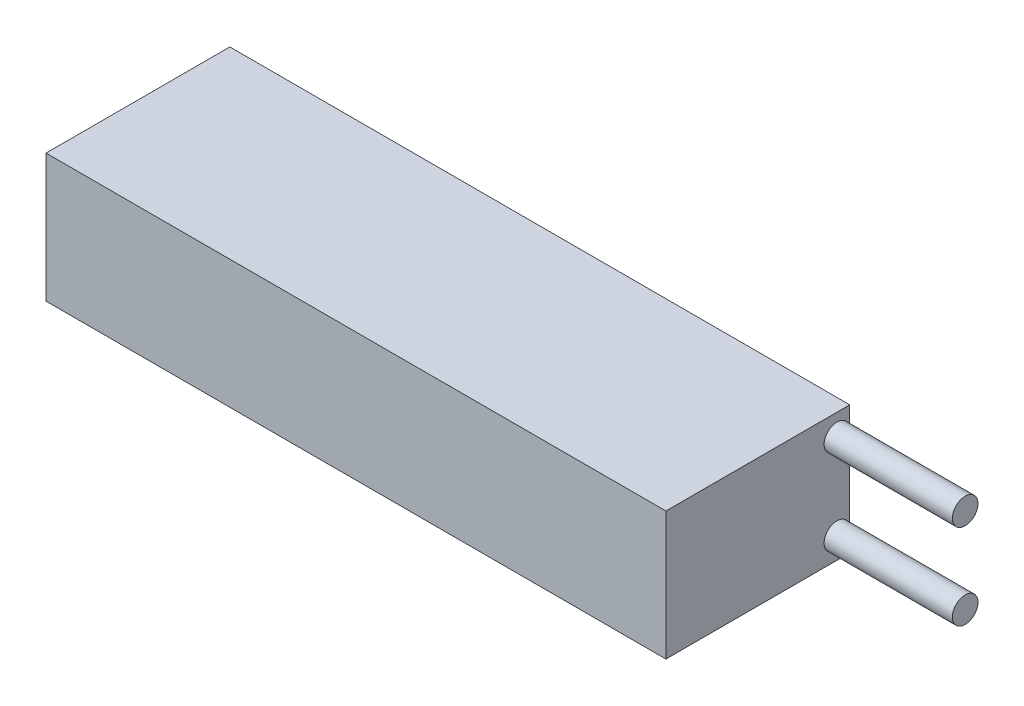
ISO-10303-21;
HEADER;
FILE_DESCRIPTION(('STEP AP214'),'2;1');
FILE_NAME('part.step','',(''),(''),'','','');
FILE_SCHEMA(('AUTOMOTIVE_DESIGN { 1 0 10303 214 1 1 1 1 }'));
ENDSEC;
DATA;
#1=APPLICATION_CONTEXT('core data for automotive mechanical design processes');
#2=APPLICATION_PROTOCOL_DEFINITION('international standard','automotive_design',2000,#1);
#3=PRODUCT_CONTEXT('',#1,'mechanical');
#4=PRODUCT('Part','Part','',(#3));
#5=PRODUCT_RELATED_PRODUCT_CATEGORY('part','',(#4));
#6=PRODUCT_DEFINITION_FORMATION('','',#4);
#7=PRODUCT_DEFINITION_CONTEXT('part definition',#1,'design');
#8=PRODUCT_DEFINITION('design','',#6,#7);
#9=PRODUCT_DEFINITION_SHAPE('','',#8);
#10=(LENGTH_UNIT() NAMED_UNIT(*) SI_UNIT(.MILLI.,.METRE.));
#11=(NAMED_UNIT(*) PLANE_ANGLE_UNIT() SI_UNIT($,.RADIAN.));
#12=(NAMED_UNIT(*) SI_UNIT($,.STERADIAN.) SOLID_ANGLE_UNIT());
#13=UNCERTAINTY_MEASURE_WITH_UNIT(LENGTH_MEASURE(1.E-05),#10,'distance_accuracy_value','');
#14=(GEOMETRIC_REPRESENTATION_CONTEXT(3) GLOBAL_UNCERTAINTY_ASSIGNED_CONTEXT((#13)) GLOBAL_UNIT_ASSIGNED_CONTEXT((#10,
#11,#12)) REPRESENTATION_CONTEXT('',''));
#15=CARTESIAN_POINT('',(0.,0.,0.));
#16=DIRECTION('',(0.,0.,1.));
#17=DIRECTION('',(1.,0.,0.));
#18=AXIS2_PLACEMENT_3D('',#15,#16,#17);
#19=CARTESIAN_POINT('',(72.5,30.,21.5));
#20=DIRECTION('',(-1.,0.,0.));
#21=DIRECTION('',(0.,0.,1.));
#22=AXIS2_PLACEMENT_3D('',#19,#20,#21);
#23=PLANE('',#22);
#24=DIRECTION('',(0.,-1.,0.));
#25=VECTOR('',#24,1.);
#26=CARTESIAN_POINT('',(72.5,30.,-21.5));
#27=LINE('',#26,#25);
#28=CARTESIAN_POINT('',(72.5,5.,-21.5));
#29=VERTEX_POINT('',#28);
#30=CARTESIAN_POINT('',(72.5,0.,-21.5));
#31=VERTEX_POINT('',#30);
#32=EDGE_CURVE('E41',#29,#31,#27,.T.);
#33=ORIENTED_EDGE('',*,*,#32,.F.);
#34=CARTESIAN_POINT('',(72.5,5.,-18.5));
#35=DIRECTION('',(1.,0.,0.));
#36=DIRECTION('',(0.,0.,1.));
#37=AXIS2_PLACEMENT_3D('',#34,#35,#36);
#38=CIRCLE('',#37,3.);
#39=EDGE_CURVE('E95',#29,#29,#38,.T.);
#40=ORIENTED_EDGE('',*,*,#39,.F.);
#41=CARTESIAN_POINT('',(72.5,25.,-21.5));
#42=VERTEX_POINT('',#41);
#43=EDGE_CURVE('E40',#42,#29,#27,.T.);
#44=ORIENTED_EDGE('',*,*,#43,.F.);
#45=CARTESIAN_POINT('',(72.5,25.,-18.5));
#46=DIRECTION('',(1.,0.,0.));
#47=DIRECTION('',(0.,0.,-1.));
#48=AXIS2_PLACEMENT_3D('',#45,#46,#47);
#49=CIRCLE('',#48,3.);
#50=EDGE_CURVE('E117',#42,#42,#49,.T.);
#51=ORIENTED_EDGE('',*,*,#50,.F.);
#52=CARTESIAN_POINT('',(72.5,30.,-21.5));
#53=VERTEX_POINT('',#52);
#54=EDGE_CURVE('E11',#53,#42,#27,.T.);
#55=ORIENTED_EDGE('',*,*,#54,.F.);
#56=DIRECTION('',(0.,0.,-1.));
#57=VECTOR('',#56,1.);
#58=CARTESIAN_POINT('',(72.5,30.,21.5));
#59=LINE('',#58,#57);
#60=CARTESIAN_POINT('',(72.5,30.,21.5));
#61=VERTEX_POINT('',#60);
#62=EDGE_CURVE('E106',#61,#53,#59,.T.);
#63=ORIENTED_EDGE('',*,*,#62,.F.);
#64=DIRECTION('',(0.,-1.,0.));
#65=VECTOR('',#64,1.);
#66=CARTESIAN_POINT('',(72.5,30.,21.5));
#67=LINE('',#66,#65);
#68=CARTESIAN_POINT('',(72.5,0.,21.5));
#69=VERTEX_POINT('',#68);
#70=EDGE_CURVE('E101',#61,#69,#67,.T.);
#71=ORIENTED_EDGE('',*,*,#70,.T.);
#72=DIRECTION('',(0.,0.,-1.));
#73=VECTOR('',#72,1.);
#74=CARTESIAN_POINT('',(72.5,0.,21.5));
#75=LINE('',#74,#73);
#76=EDGE_CURVE('E97',#69,#31,#75,.T.);
#77=ORIENTED_EDGE('',*,*,#76,.T.);
#78=EDGE_LOOP('',(#33,#40,#44,#51,#55,#63,#71,#77));
#79=FACE_BOUND('',#78,.T.);
#80=ADVANCED_FACE('F32',(#79),#23,.F.);
#81=CARTESIAN_POINT('',(-72.5,30.,-21.5));
#82=DIRECTION('',(0.,0.,1.));
#83=DIRECTION('',(1.,0.,0.));
#84=AXIS2_PLACEMENT_3D('',#81,#82,#83);
#85=PLANE('',#84);
#86=DIRECTION('',(-1.,0.,0.));
#87=VECTOR('',#86,1.);
#88=CARTESIAN_POINT('',(-72.5,0.,-21.5));
#89=LINE('',#88,#87);
#90=CARTESIAN_POINT('',(-72.5,0.,-21.5));
#91=VERTEX_POINT('',#90);
#92=EDGE_CURVE('E108',#31,#91,#89,.T.);
#93=ORIENTED_EDGE('',*,*,#92,.T.);
#94=DIRECTION('',(0.,-1.,0.));
#95=VECTOR('',#94,1.);
#96=CARTESIAN_POINT('',(-72.5,30.,-21.5));
#97=LINE('',#96,#95);
#98=CARTESIAN_POINT('',(-72.5,30.,-21.5));
#99=VERTEX_POINT('',#98);
#100=EDGE_CURVE('E98',#99,#91,#97,.T.);
#101=ORIENTED_EDGE('',*,*,#100,.F.);
#102=DIRECTION('',(-1.,0.,0.));
#103=VECTOR('',#102,1.);
#104=CARTESIAN_POINT('',(-72.5,30.,-21.5));
#105=LINE('',#104,#103);
#106=EDGE_CURVE('E80',#53,#99,#105,.T.);
#107=ORIENTED_EDGE('',*,*,#106,.F.);
#108=ORIENTED_EDGE('',*,*,#54,.T.);
#109=ORIENTED_EDGE('',*,*,#43,.T.);
#110=ORIENTED_EDGE('',*,*,#32,.T.);
#111=EDGE_LOOP('',(#93,#101,#107,#108,#109,#110));
#112=FACE_BOUND('',#111,.T.);
#113=ADVANCED_FACE('F87',(#112),#85,.F.);
#114=CARTESIAN_POINT('',(-72.5,30.,21.5));
#115=DIRECTION('',(1.,0.,0.));
#116=DIRECTION('',(0.,0.,-1.));
#117=AXIS2_PLACEMENT_3D('',#114,#115,#116);
#118=PLANE('',#117);
#119=DIRECTION('',(0.,0.,1.));
#120=VECTOR('',#119,1.);
#121=CARTESIAN_POINT('',(-72.5,0.,21.5));
#122=LINE('',#121,#120);
#123=CARTESIAN_POINT('',(-72.5,0.,21.5));
#124=VERTEX_POINT('',#123);
#125=EDGE_CURVE('E67',#91,#124,#122,.T.);
#126=ORIENTED_EDGE('',*,*,#125,.T.);
#127=DIRECTION('',(0.,-1.,0.));
#128=VECTOR('',#127,1.);
#129=CARTESIAN_POINT('',(-72.5,30.,21.5));
#130=LINE('',#129,#128);
#131=CARTESIAN_POINT('',(-72.5,30.,21.5));
#132=VERTEX_POINT('',#131);
#133=EDGE_CURVE('E99',#132,#124,#130,.T.);
#134=ORIENTED_EDGE('',*,*,#133,.F.);
#135=DIRECTION('',(0.,0.,1.));
#136=VECTOR('',#135,1.);
#137=CARTESIAN_POINT('',(-72.5,30.,21.5));
#138=LINE('',#137,#136);
#139=EDGE_CURVE('E113',#99,#132,#138,.T.);
#140=ORIENTED_EDGE('',*,*,#139,.F.);
#141=ORIENTED_EDGE('',*,*,#100,.T.);
#142=EDGE_LOOP('',(#126,#134,#140,#141));
#143=FACE_BOUND('',#142,.T.);
#144=ADVANCED_FACE('F146',(#143),#118,.F.);
#145=CARTESIAN_POINT('',(-72.5,30.,21.5));
#146=DIRECTION('',(0.,0.,-1.));
#147=DIRECTION('',(-1.,0.,0.));
#148=AXIS2_PLACEMENT_3D('',#145,#146,#147);
#149=PLANE('',#148);
#150=DIRECTION('',(1.,0.,0.));
#151=VECTOR('',#150,1.);
#152=CARTESIAN_POINT('',(-72.5,0.,21.5));
#153=LINE('',#152,#151);
#154=EDGE_CURVE('E73',#124,#69,#153,.T.);
#155=ORIENTED_EDGE('',*,*,#154,.T.);
#156=ORIENTED_EDGE('',*,*,#70,.F.);
#157=DIRECTION('',(1.,0.,0.));
#158=VECTOR('',#157,1.);
#159=CARTESIAN_POINT('',(-72.5,30.,21.5));
#160=LINE('',#159,#158);
#161=EDGE_CURVE('E49',#132,#61,#160,.T.);
#162=ORIENTED_EDGE('',*,*,#161,.F.);
#163=ORIENTED_EDGE('',*,*,#133,.T.);
#164=EDGE_LOOP('',(#155,#156,#162,#163));
#165=FACE_BOUND('',#164,.T.);
#166=ADVANCED_FACE('F150',(#165),#149,.F.);
#167=CARTESIAN_POINT('',(0.,30.,0.));
#168=DIRECTION('',(0.,-1.,0.));
#169=DIRECTION('',(0.,0.,-1.));
#170=AXIS2_PLACEMENT_3D('',#167,#168,#169);
#171=PLANE('',#170);
#172=ORIENTED_EDGE('',*,*,#62,.T.);
#173=ORIENTED_EDGE('',*,*,#106,.T.);
#174=ORIENTED_EDGE('',*,*,#139,.T.);
#175=ORIENTED_EDGE('',*,*,#161,.T.);
#176=EDGE_LOOP('',(#172,#173,#174,#175));
#177=FACE_BOUND('',#176,.T.);
#178=ADVANCED_FACE('F155',(#177),#171,.F.);
#179=CARTESIAN_POINT('',(0.,0.,0.));
#180=DIRECTION('',(0.,-1.,0.));
#181=DIRECTION('',(0.,0.,-1.));
#182=AXIS2_PLACEMENT_3D('',#179,#180,#181);
#183=PLANE('',#182);
#184=ORIENTED_EDGE('',*,*,#76,.F.);
#185=ORIENTED_EDGE('',*,*,#154,.F.);
#186=ORIENTED_EDGE('',*,*,#125,.F.);
#187=ORIENTED_EDGE('',*,*,#92,.F.);
#188=EDGE_LOOP('',(#184,#185,#186,#187));
#189=FACE_BOUND('',#188,.T.);
#190=ADVANCED_FACE('F156',(#189),#183,.T.);
#191=CARTESIAN_POINT('',(102.5,25.,-18.5));
#192=DIRECTION('',(-1.,0.,0.));
#193=DIRECTION('',(0.,0.,1.));
#194=AXIS2_PLACEMENT_3D('',#191,#192,#193);
#195=CYLINDRICAL_SURFACE('',#194,3.);
#196=CARTESIAN_POINT('',(102.5,25.,-18.5));
#197=DIRECTION('',(1.,0.,0.));
#198=DIRECTION('',(0.,0.,-1.));
#199=AXIS2_PLACEMENT_3D('',#196,#197,#198);
#200=CIRCLE('',#199,3.);
#201=CARTESIAN_POINT('',(102.5,25.,-21.5));
#202=VERTEX_POINT('',#201);
#203=EDGE_CURVE('E111',#202,#202,#200,.T.);
#204=ORIENTED_EDGE('',*,*,#203,.F.);
#205=EDGE_LOOP('',(#204));
#206=FACE_BOUND('',#205,.T.);
#207=ORIENTED_EDGE('',*,*,#50,.T.);
#208=EDGE_LOOP('',(#207));
#209=FACE_BOUND('',#208,.T.);
#210=ADVANCED_FACE('F139',(#206,#209),#195,.T.);
#211=CARTESIAN_POINT('',(102.5,25.,-18.5));
#212=DIRECTION('',(1.,0.,0.));
#213=DIRECTION('',(0.,0.,-1.));
#214=AXIS2_PLACEMENT_3D('',#211,#212,#213);
#215=PLANE('',#214);
#216=ORIENTED_EDGE('',*,*,#203,.T.);
#217=EDGE_LOOP('',(#216));
#218=FACE_BOUND('',#217,.T.);
#219=ADVANCED_FACE('F132',(#218),#215,.T.);
#220=CARTESIAN_POINT('',(102.5,5.,-18.5));
#221=DIRECTION('',(-1.,0.,0.));
#222=DIRECTION('',(0.,0.,1.));
#223=AXIS2_PLACEMENT_3D('',#220,#221,#222);
#224=CYLINDRICAL_SURFACE('',#223,3.);
#225=CARTESIAN_POINT('',(102.5,5.,-18.5));
#226=DIRECTION('',(1.,0.,0.));
#227=DIRECTION('',(0.,0.,1.));
#228=AXIS2_PLACEMENT_3D('',#225,#226,#227);
#229=CIRCLE('',#228,3.);
#230=CARTESIAN_POINT('',(102.5,5.,-15.5));
#231=VERTEX_POINT('',#230);
#232=EDGE_CURVE('E120',#231,#231,#229,.T.);
#233=ORIENTED_EDGE('',*,*,#232,.F.);
#234=EDGE_LOOP('',(#233));
#235=FACE_BOUND('',#234,.T.);
#236=ORIENTED_EDGE('',*,*,#39,.T.);
#237=EDGE_LOOP('',(#236));
#238=FACE_BOUND('',#237,.T.);
#239=ADVANCED_FACE('F129',(#235,#238),#224,.T.);
#240=CARTESIAN_POINT('',(102.5,5.,-18.5));
#241=DIRECTION('',(-1.,0.,0.));
#242=DIRECTION('',(0.,0.,1.));
#243=AXIS2_PLACEMENT_3D('',#240,#241,#242);
#244=PLANE('',#243);
#245=ORIENTED_EDGE('',*,*,#232,.T.);
#246=EDGE_LOOP('',(#245));
#247=FACE_BOUND('',#246,.T.);
#248=ADVANCED_FACE('F127',(#247),#244,.F.);
#249=CLOSED_SHELL('',(#80,#113,#144,#166,#178,#190,#210,#219,#239,#248));
#250=MANIFOLD_SOLID_BREP('B2',#249);
#251=ADVANCED_BREP_SHAPE_REPRESENTATION('',(#18,#250),#14);
#252=SHAPE_DEFINITION_REPRESENTATION(#9,#251);
ENDSEC;
END-ISO-10303-21;
